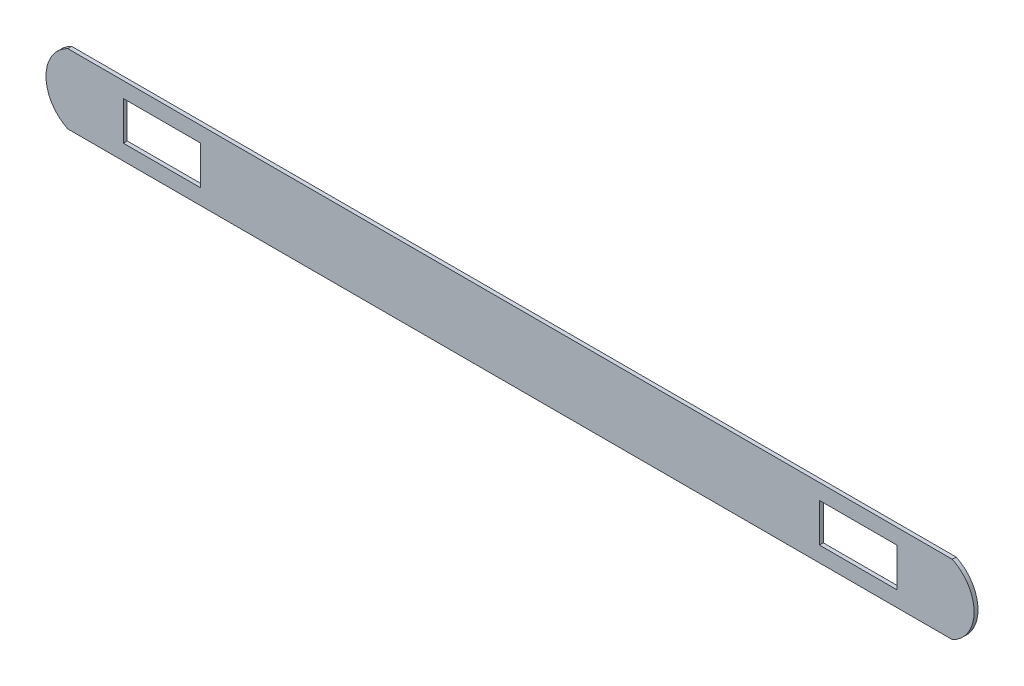
ISO-10303-21;
HEADER;
FILE_DESCRIPTION(('STEP AP214'),'2;1');
FILE_NAME('part.step','',(''),(''),'','','');
FILE_SCHEMA(('AUTOMOTIVE_DESIGN { 1 0 10303 214 1 1 1 1 }'));
ENDSEC;
DATA;
#1=APPLICATION_CONTEXT('core data for automotive mechanical design processes');
#2=APPLICATION_PROTOCOL_DEFINITION('international standard','automotive_design',2000,#1);
#3=PRODUCT_CONTEXT('',#1,'mechanical');
#4=PRODUCT('Part','Part','',(#3));
#5=PRODUCT_RELATED_PRODUCT_CATEGORY('part','',(#4));
#6=PRODUCT_DEFINITION_FORMATION('','',#4);
#7=PRODUCT_DEFINITION_CONTEXT('part definition',#1,'design');
#8=PRODUCT_DEFINITION('design','',#6,#7);
#9=PRODUCT_DEFINITION_SHAPE('','',#8);
#10=(LENGTH_UNIT() NAMED_UNIT(*) SI_UNIT(.MILLI.,.METRE.));
#11=(NAMED_UNIT(*) PLANE_ANGLE_UNIT() SI_UNIT($,.RADIAN.));
#12=(NAMED_UNIT(*) SI_UNIT($,.STERADIAN.) SOLID_ANGLE_UNIT());
#13=UNCERTAINTY_MEASURE_WITH_UNIT(LENGTH_MEASURE(1.E-05),#10,'distance_accuracy_value','');
#14=(GEOMETRIC_REPRESENTATION_CONTEXT(3) GLOBAL_UNCERTAINTY_ASSIGNED_CONTEXT((#13)) GLOBAL_UNIT_ASSIGNED_CONTEXT((#10,
#11,#12)) REPRESENTATION_CONTEXT('',''));
#15=CARTESIAN_POINT('',(0.,0.,0.));
#16=DIRECTION('',(0.,0.,1.));
#17=DIRECTION('',(1.,0.,0.));
#18=AXIS2_PLACEMENT_3D('',#15,#16,#17);
#19=CARTESIAN_POINT('',(0.,-45.,0.));
#20=DIRECTION('',(0.,1.,0.));
#21=DIRECTION('',(0.,0.,1.));
#22=AXIS2_PLACEMENT_3D('',#19,#20,#21);
#23=PLANE('',#22);
#24=DIRECTION('',(0.,0.,-1.));
#25=VECTOR('',#24,1.);
#26=CARTESIAN_POINT('',(-524.528236675635,-45.,80.));
#27=LINE('',#26,#25);
#28=CARTESIAN_POINT('',(-524.528236675635,-45.,0.));
#29=VERTEX_POINT('',#28);
#30=CARTESIAN_POINT('',(-524.528236675635,-45.,5.));
#31=VERTEX_POINT('',#30);
#32=EDGE_CURVE('E136',#29,#31,#27,.F.);
#33=ORIENTED_EDGE('',*,*,#32,.F.);
#34=DIRECTION('',(-1.,0.,0.));
#35=VECTOR('',#34,1.);
#36=CARTESIAN_POINT('',(-502.733741957931,-45.,0.));
#37=LINE('',#36,#35);
#38=CARTESIAN_POINT('',(619.060752759772,-45.,0.));
#39=VERTEX_POINT('',#38);
#40=EDGE_CURVE('E133',#39,#29,#37,.T.);
#41=ORIENTED_EDGE('',*,*,#40,.F.);
#42=DIRECTION('',(0.,0.,-1.));
#43=VECTOR('',#42,1.);
#44=CARTESIAN_POINT('',(619.060752759772,-45.,80.));
#45=LINE('',#44,#43);
#46=CARTESIAN_POINT('',(619.060752759772,-45.,5.));
#47=VERTEX_POINT('',#46);
#48=EDGE_CURVE('E135',#47,#39,#45,.T.);
#49=ORIENTED_EDGE('',*,*,#48,.F.);
#50=DIRECTION('',(-1.,0.,0.));
#51=VECTOR('',#50,1.);
#52=CARTESIAN_POINT('',(597.266258042068,-45.,5.));
#53=LINE('',#52,#51);
#54=EDGE_CURVE('E123',#47,#31,#53,.T.);
#55=ORIENTED_EDGE('',*,*,#54,.T.);
#56=EDGE_LOOP('',(#33,#41,#49,#55));
#57=FACE_BOUND('',#56,.T.);
#58=ADVANCED_FACE('F34',(#57),#23,.F.);
#59=CARTESIAN_POINT('',(447.266258042068,-25.,-5.));
#60=DIRECTION('',(0.,-1.,0.));
#61=DIRECTION('',(0.,0.,-1.));
#62=AXIS2_PLACEMENT_3D('',#59,#60,#61);
#63=PLANE('',#62);
#64=DIRECTION('',(0.,0.,1.));
#65=VECTOR('',#64,1.);
#66=CARTESIAN_POINT('',(447.266258042068,-25.,-5.));
#67=LINE('',#66,#65);
#68=CARTESIAN_POINT('',(447.266258042068,-25.,0.));
#69=VERTEX_POINT('',#68);
#70=CARTESIAN_POINT('',(447.266258042068,-25.,5.));
#71=VERTEX_POINT('',#70);
#72=EDGE_CURVE('E178',#69,#71,#67,.T.);
#73=ORIENTED_EDGE('',*,*,#72,.T.);
#74=DIRECTION('',(1.,0.,0.));
#75=VECTOR('',#74,1.);
#76=CARTESIAN_POINT('',(447.266258042068,-25.,5.));
#77=LINE('',#76,#75);
#78=CARTESIAN_POINT('',(547.266258042068,-25.,5.));
#79=VERTEX_POINT('',#78);
#80=EDGE_CURVE('E194',#71,#79,#77,.T.);
#81=ORIENTED_EDGE('',*,*,#80,.T.);
#82=DIRECTION('',(0.,0.,1.));
#83=VECTOR('',#82,1.);
#84=CARTESIAN_POINT('',(547.266258042068,-25.,-5.));
#85=LINE('',#84,#83);
#86=CARTESIAN_POINT('',(547.266258042068,-25.,0.));
#87=VERTEX_POINT('',#86);
#88=EDGE_CURVE('E181',#87,#79,#85,.T.);
#89=ORIENTED_EDGE('',*,*,#88,.F.);
#90=DIRECTION('',(1.,0.,0.));
#91=VECTOR('',#90,1.);
#92=CARTESIAN_POINT('',(-502.733741957931,-25.,0.));
#93=LINE('',#92,#91);
#94=EDGE_CURVE('E174',#69,#87,#93,.T.);
#95=ORIENTED_EDGE('',*,*,#94,.F.);
#96=EDGE_LOOP('',(#73,#81,#89,#95));
#97=FACE_BOUND('',#96,.T.);
#98=ADVANCED_FACE('F245',(#97),#63,.F.);
#99=CARTESIAN_POINT('',(547.266258042068,25.,-5.));
#100=DIRECTION('',(1.,0.,0.));
#101=DIRECTION('',(0.,0.,-1.));
#102=AXIS2_PLACEMENT_3D('',#99,#100,#101);
#103=PLANE('',#102);
#104=ORIENTED_EDGE('',*,*,#88,.T.);
#105=DIRECTION('',(0.,1.,0.));
#106=VECTOR('',#105,1.);
#107=CARTESIAN_POINT('',(547.266258042068,25.,5.));
#108=LINE('',#107,#106);
#109=CARTESIAN_POINT('',(547.266258042068,25.,5.));
#110=VERTEX_POINT('',#109);
#111=EDGE_CURVE('E191',#79,#110,#108,.T.);
#112=ORIENTED_EDGE('',*,*,#111,.T.);
#113=DIRECTION('',(0.,0.,1.));
#114=VECTOR('',#113,1.);
#115=CARTESIAN_POINT('',(547.266258042068,25.,-5.));
#116=LINE('',#115,#114);
#117=CARTESIAN_POINT('',(547.266258042068,25.,0.));
#118=VERTEX_POINT('',#117);
#119=EDGE_CURVE('E184',#118,#110,#116,.T.);
#120=ORIENTED_EDGE('',*,*,#119,.F.);
#121=DIRECTION('',(0.,1.,0.));
#122=VECTOR('',#121,1.);
#123=CARTESIAN_POINT('',(547.266258042068,0.,0.));
#124=LINE('',#123,#122);
#125=EDGE_CURVE('E171',#87,#118,#124,.T.);
#126=ORIENTED_EDGE('',*,*,#125,.F.);
#127=EDGE_LOOP('',(#104,#112,#120,#126));
#128=FACE_BOUND('',#127,.T.);
#129=ADVANCED_FACE('F250',(#128),#103,.F.);
#130=CARTESIAN_POINT('',(447.266258042068,25.,-5.));
#131=DIRECTION('',(0.,1.,0.));
#132=DIRECTION('',(-1.,0.,0.));
#133=AXIS2_PLACEMENT_3D('',#130,#131,#132);
#134=PLANE('',#133);
#135=ORIENTED_EDGE('',*,*,#119,.T.);
#136=DIRECTION('',(-1.,0.,0.));
#137=VECTOR('',#136,1.);
#138=CARTESIAN_POINT('',(447.266258042068,25.,5.));
#139=LINE('',#138,#137);
#140=CARTESIAN_POINT('',(447.266258042068,25.,5.));
#141=VERTEX_POINT('',#140);
#142=EDGE_CURVE('E182',#110,#141,#139,.T.);
#143=ORIENTED_EDGE('',*,*,#142,.T.);
#144=DIRECTION('',(0.,0.,1.));
#145=VECTOR('',#144,1.);
#146=CARTESIAN_POINT('',(447.266258042068,25.,-5.));
#147=LINE('',#146,#145);
#148=CARTESIAN_POINT('',(447.266258042068,25.,0.));
#149=VERTEX_POINT('',#148);
#150=EDGE_CURVE('E186',#149,#141,#147,.T.);
#151=ORIENTED_EDGE('',*,*,#150,.F.);
#152=DIRECTION('',(-1.,0.,0.));
#153=VECTOR('',#152,1.);
#154=CARTESIAN_POINT('',(-502.733741957931,25.0000000000004,0.));
#155=LINE('',#154,#153);
#156=EDGE_CURVE('E168',#118,#149,#155,.T.);
#157=ORIENTED_EDGE('',*,*,#156,.F.);
#158=EDGE_LOOP('',(#135,#143,#151,#157));
#159=FACE_BOUND('',#158,.T.);
#160=ADVANCED_FACE('F275',(#159),#134,.F.);
#161=CARTESIAN_POINT('',(447.266258042068,25.,-5.));
#162=DIRECTION('',(-1.,0.,0.));
#163=DIRECTION('',(0.,0.,1.));
#164=AXIS2_PLACEMENT_3D('',#161,#162,#163);
#165=PLANE('',#164);
#166=ORIENTED_EDGE('',*,*,#150,.T.);
#167=DIRECTION('',(0.,-1.,0.));
#168=VECTOR('',#167,1.);
#169=CARTESIAN_POINT('',(447.266258042068,25.,5.));
#170=LINE('',#169,#168);
#171=EDGE_CURVE('E149',#141,#71,#170,.T.);
#172=ORIENTED_EDGE('',*,*,#171,.T.);
#173=ORIENTED_EDGE('',*,*,#72,.F.);
#174=DIRECTION('',(0.,-1.,0.));
#175=VECTOR('',#174,1.);
#176=CARTESIAN_POINT('',(447.266258042068,0.,0.));
#177=LINE('',#176,#175);
#178=EDGE_CURVE('E165',#149,#69,#177,.T.);
#179=ORIENTED_EDGE('',*,*,#178,.F.);
#180=EDGE_LOOP('',(#166,#172,#173,#179));
#181=FACE_BOUND('',#180,.T.);
#182=ADVANCED_FACE('F273',(#181),#165,.F.);
#183=CARTESIAN_POINT('',(-452.733741957932,-25.,-5.));
#184=DIRECTION('',(0.,-1.,0.));
#185=DIRECTION('',(0.,0.,-1.));
#186=AXIS2_PLACEMENT_3D('',#183,#184,#185);
#187=PLANE('',#186);
#188=DIRECTION('',(0.,0.,1.));
#189=VECTOR('',#188,1.);
#190=CARTESIAN_POINT('',(-452.733741957932,-25.,-5.));
#191=LINE('',#190,#189);
#192=CARTESIAN_POINT('',(-452.733741957932,-25.,0.));
#193=VERTEX_POINT('',#192);
#194=CARTESIAN_POINT('',(-452.733741957931,-25.,5.));
#195=VERTEX_POINT('',#194);
#196=EDGE_CURVE('E198',#193,#195,#191,.T.);
#197=ORIENTED_EDGE('',*,*,#196,.T.);
#198=DIRECTION('',(1.,0.,0.));
#199=VECTOR('',#198,1.);
#200=CARTESIAN_POINT('',(-452.733741957932,-25.,5.));
#201=LINE('',#200,#199);
#202=CARTESIAN_POINT('',(-352.733741957931,-25.,5.));
#203=VERTEX_POINT('',#202);
#204=EDGE_CURVE('E212',#195,#203,#201,.T.);
#205=ORIENTED_EDGE('',*,*,#204,.T.);
#206=DIRECTION('',(0.,0.,1.));
#207=VECTOR('',#206,1.);
#208=CARTESIAN_POINT('',(-352.733741957931,-25.,-5.));
#209=LINE('',#208,#207);
#210=CARTESIAN_POINT('',(-352.733741957931,-25.,0.));
#211=VERTEX_POINT('',#210);
#212=EDGE_CURVE('E201',#211,#203,#209,.T.);
#213=ORIENTED_EDGE('',*,*,#212,.F.);
#214=DIRECTION('',(1.,0.,0.));
#215=VECTOR('',#214,1.);
#216=CARTESIAN_POINT('',(-502.733741957931,-25.,0.));
#217=LINE('',#216,#215);
#218=EDGE_CURVE('E162',#193,#211,#217,.T.);
#219=ORIENTED_EDGE('',*,*,#218,.F.);
#220=EDGE_LOOP('',(#197,#205,#213,#219));
#221=FACE_BOUND('',#220,.T.);
#222=ADVANCED_FACE('F223',(#221),#187,.F.);
#223=CARTESIAN_POINT('',(-352.733741957931,25.,-5.));
#224=DIRECTION('',(1.,0.,0.));
#225=DIRECTION('',(0.,0.,-1.));
#226=AXIS2_PLACEMENT_3D('',#223,#224,#225);
#227=PLANE('',#226);
#228=ORIENTED_EDGE('',*,*,#212,.T.);
#229=DIRECTION('',(0.,1.,0.));
#230=VECTOR('',#229,1.);
#231=CARTESIAN_POINT('',(-352.733741957931,25.,5.));
#232=LINE('',#231,#230);
#233=CARTESIAN_POINT('',(-352.733741957931,25.,5.));
#234=VERTEX_POINT('',#233);
#235=EDGE_CURVE('E209',#203,#234,#232,.T.);
#236=ORIENTED_EDGE('',*,*,#235,.T.);
#237=DIRECTION('',(0.,0.,1.));
#238=VECTOR('',#237,1.);
#239=CARTESIAN_POINT('',(-352.733741957931,25.,-5.));
#240=LINE('',#239,#238);
#241=CARTESIAN_POINT('',(-352.733741957931,25.,0.));
#242=VERTEX_POINT('',#241);
#243=EDGE_CURVE('E204',#242,#234,#240,.T.);
#244=ORIENTED_EDGE('',*,*,#243,.F.);
#245=DIRECTION('',(0.,1.,0.));
#246=VECTOR('',#245,1.);
#247=CARTESIAN_POINT('',(-352.733741957931,0.,0.));
#248=LINE('',#247,#246);
#249=EDGE_CURVE('E159',#211,#242,#248,.T.);
#250=ORIENTED_EDGE('',*,*,#249,.F.);
#251=EDGE_LOOP('',(#228,#236,#244,#250));
#252=FACE_BOUND('',#251,.T.);
#253=ADVANCED_FACE('F228',(#252),#227,.F.);
#254=CARTESIAN_POINT('',(-452.733741957932,25.,-5.));
#255=DIRECTION('',(0.,1.,0.));
#256=DIRECTION('',(0.,0.,1.));
#257=AXIS2_PLACEMENT_3D('',#254,#255,#256);
#258=PLANE('',#257);
#259=ORIENTED_EDGE('',*,*,#243,.T.);
#260=DIRECTION('',(-1.,0.,0.));
#261=VECTOR('',#260,1.);
#262=CARTESIAN_POINT('',(-452.733741957932,25.,5.));
#263=LINE('',#262,#261);
#264=CARTESIAN_POINT('',(-452.733741957932,25.,5.));
#265=VERTEX_POINT('',#264);
#266=EDGE_CURVE('E202',#234,#265,#263,.T.);
#267=ORIENTED_EDGE('',*,*,#266,.T.);
#268=DIRECTION('',(0.,0.,1.));
#269=VECTOR('',#268,1.);
#270=CARTESIAN_POINT('',(-452.733741957932,25.,-5.));
#271=LINE('',#270,#269);
#272=CARTESIAN_POINT('',(-452.733741957932,25.,0.));
#273=VERTEX_POINT('',#272);
#274=EDGE_CURVE('E177',#273,#265,#271,.T.);
#275=ORIENTED_EDGE('',*,*,#274,.F.);
#276=DIRECTION('',(-1.,0.,0.));
#277=VECTOR('',#276,1.);
#278=CARTESIAN_POINT('',(-502.733741957931,25.,0.));
#279=LINE('',#278,#277);
#280=EDGE_CURVE('E156',#242,#273,#279,.T.);
#281=ORIENTED_EDGE('',*,*,#280,.F.);
#282=EDGE_LOOP('',(#259,#267,#275,#281));
#283=FACE_BOUND('',#282,.T.);
#284=ADVANCED_FACE('F234',(#283),#258,.F.);
#285=CARTESIAN_POINT('',(-452.733741957932,25.,-5.));
#286=DIRECTION('',(-1.,0.,0.));
#287=DIRECTION('',(0.,0.,1.));
#288=AXIS2_PLACEMENT_3D('',#285,#286,#287);
#289=PLANE('',#288);
#290=ORIENTED_EDGE('',*,*,#274,.T.);
#291=DIRECTION('',(0.,-1.,0.));
#292=VECTOR('',#291,1.);
#293=CARTESIAN_POINT('',(-452.733741957932,25.,5.));
#294=LINE('',#293,#292);
#295=EDGE_CURVE('E188',#265,#195,#294,.T.);
#296=ORIENTED_EDGE('',*,*,#295,.T.);
#297=ORIENTED_EDGE('',*,*,#196,.F.);
#298=DIRECTION('',(0.,-1.,0.));
#299=VECTOR('',#298,1.);
#300=CARTESIAN_POINT('',(-452.733741957932,0.,0.));
#301=LINE('',#300,#299);
#302=EDGE_CURVE('E148',#273,#193,#301,.T.);
#303=ORIENTED_EDGE('',*,*,#302,.F.);
#304=EDGE_LOOP('',(#290,#296,#297,#303));
#305=FACE_BOUND('',#304,.T.);
#306=ADVANCED_FACE('F218',(#305),#289,.F.);
#307=CARTESIAN_POINT('',(597.266258042068,0.,80.));
#308=DIRECTION('',(0.,0.,-1.));
#309=DIRECTION('',(-1.,0.,0.));
#310=AXIS2_PLACEMENT_3D('',#307,#308,#309);
#311=CYLINDRICAL_SURFACE('',#310,50.);
#312=CARTESIAN_POINT('',(597.266258042068,0.,5.));
#313=DIRECTION('',(0.,0.,1.));
#314=DIRECTION('',(1.,0.,0.));
#315=AXIS2_PLACEMENT_3D('',#312,#313,#314);
#316=CIRCLE('',#315,50.);
#317=CARTESIAN_POINT('',(619.060752759772,45.,5.));
#318=VERTEX_POINT('',#317);
#319=EDGE_CURVE('E51',#47,#318,#316,.T.);
#320=ORIENTED_EDGE('',*,*,#319,.F.);
#321=ORIENTED_EDGE('',*,*,#48,.T.);
#322=CARTESIAN_POINT('',(597.266258042068,0.,0.));
#323=DIRECTION('',(0.,0.,1.));
#324=DIRECTION('',(1.,0.,0.));
#325=AXIS2_PLACEMENT_3D('',#322,#323,#324);
#326=CIRCLE('',#325,50.);
#327=CARTESIAN_POINT('',(619.060752759772,45.,0.));
#328=VERTEX_POINT('',#327);
#329=EDGE_CURVE('E38',#39,#328,#326,.T.);
#330=ORIENTED_EDGE('',*,*,#329,.T.);
#331=DIRECTION('',(0.,0.,-1.));
#332=VECTOR('',#331,1.);
#333=CARTESIAN_POINT('',(619.060752759772,45.,80.));
#334=LINE('',#333,#332);
#335=EDGE_CURVE('E11',#328,#318,#334,.F.);
#336=ORIENTED_EDGE('',*,*,#335,.T.);
#337=EDGE_LOOP('',(#320,#321,#330,#336));
#338=FACE_BOUND('',#337,.T.);
#339=ADVANCED_FACE('F138',(#338),#311,.T.);
#340=CARTESIAN_POINT('',(0.,45.,0.));
#341=DIRECTION('',(0.,-1.,0.));
#342=DIRECTION('',(0.,0.,-1.));
#343=AXIS2_PLACEMENT_3D('',#340,#341,#342);
#344=PLANE('',#343);
#345=ORIENTED_EDGE('',*,*,#335,.F.);
#346=DIRECTION('',(1.,0.,0.));
#347=VECTOR('',#346,1.);
#348=CARTESIAN_POINT('',(-502.733741957931,45.,0.));
#349=LINE('',#348,#347);
#350=CARTESIAN_POINT('',(-524.528236675635,45.,0.));
#351=VERTEX_POINT('',#350);
#352=EDGE_CURVE('E132',#351,#328,#349,.T.);
#353=ORIENTED_EDGE('',*,*,#352,.F.);
#354=DIRECTION('',(0.,0.,-1.));
#355=VECTOR('',#354,1.);
#356=CARTESIAN_POINT('',(-524.528236675635,45.,80.));
#357=LINE('',#356,#355);
#358=CARTESIAN_POINT('',(-524.528236675635,45.,5.));
#359=VERTEX_POINT('',#358);
#360=EDGE_CURVE('E43',#359,#351,#357,.T.);
#361=ORIENTED_EDGE('',*,*,#360,.F.);
#362=DIRECTION('',(1.,0.,0.));
#363=VECTOR('',#362,1.);
#364=CARTESIAN_POINT('',(597.266258042068,45.,5.));
#365=LINE('',#364,#363);
#366=EDGE_CURVE('E142',#359,#318,#365,.T.);
#367=ORIENTED_EDGE('',*,*,#366,.T.);
#368=EDGE_LOOP('',(#345,#353,#361,#367));
#369=FACE_BOUND('',#368,.T.);
#370=ADVANCED_FACE('F264',(#369),#344,.F.);
#371=CARTESIAN_POINT('',(597.266258042068,-45.,5.));
#372=DIRECTION('',(0.,0.,1.));
#373=DIRECTION('',(1.,0.,0.));
#374=AXIS2_PLACEMENT_3D('',#371,#372,#373);
#375=PLANE('',#374);
#376=ORIENTED_EDGE('',*,*,#54,.F.);
#377=ORIENTED_EDGE('',*,*,#319,.T.);
#378=ORIENTED_EDGE('',*,*,#366,.F.);
#379=CARTESIAN_POINT('',(-502.733741957931,0.,5.));
#380=DIRECTION('',(0.,0.,1.));
#381=DIRECTION('',(1.,0.,0.));
#382=AXIS2_PLACEMENT_3D('',#379,#380,#381);
#383=CIRCLE('',#382,50.);
#384=EDGE_CURVE('E128',#359,#31,#383,.T.);
#385=ORIENTED_EDGE('',*,*,#384,.T.);
#386=EDGE_LOOP('',(#376,#377,#378,#385));
#387=FACE_BOUND('',#386,.T.);
#388=ORIENTED_EDGE('',*,*,#295,.F.);
#389=ORIENTED_EDGE('',*,*,#266,.F.);
#390=ORIENTED_EDGE('',*,*,#235,.F.);
#391=ORIENTED_EDGE('',*,*,#204,.F.);
#392=EDGE_LOOP('',(#388,#389,#390,#391));
#393=FACE_BOUND('',#392,.T.);
#394=ORIENTED_EDGE('',*,*,#171,.F.);
#395=ORIENTED_EDGE('',*,*,#142,.F.);
#396=ORIENTED_EDGE('',*,*,#111,.F.);
#397=ORIENTED_EDGE('',*,*,#80,.F.);
#398=EDGE_LOOP('',(#394,#395,#396,#397));
#399=FACE_BOUND('',#398,.T.);
#400=ADVANCED_FACE('F125',(#387,#393,#399),#375,.T.);
#401=CARTESIAN_POINT('',(-502.733741957931,0.,0.));
#402=DIRECTION('',(0.,0.,1.));
#403=DIRECTION('',(1.,0.,0.));
#404=AXIS2_PLACEMENT_3D('',#401,#402,#403);
#405=PLANE('',#404);
#406=ORIENTED_EDGE('',*,*,#329,.F.);
#407=ORIENTED_EDGE('',*,*,#40,.T.);
#408=CARTESIAN_POINT('',(-502.733741957931,0.,0.));
#409=DIRECTION('',(0.,0.,1.));
#410=DIRECTION('',(1.,0.,0.));
#411=AXIS2_PLACEMENT_3D('',#408,#409,#410);
#412=CIRCLE('',#411,50.);
#413=EDGE_CURVE('E145',#351,#29,#412,.T.);
#414=ORIENTED_EDGE('',*,*,#413,.F.);
#415=ORIENTED_EDGE('',*,*,#352,.T.);
#416=EDGE_LOOP('',(#406,#407,#414,#415));
#417=FACE_BOUND('',#416,.T.);
#418=ORIENTED_EDGE('',*,*,#280,.T.);
#419=ORIENTED_EDGE('',*,*,#302,.T.);
#420=ORIENTED_EDGE('',*,*,#218,.T.);
#421=ORIENTED_EDGE('',*,*,#249,.T.);
#422=EDGE_LOOP('',(#418,#419,#420,#421));
#423=FACE_BOUND('',#422,.T.);
#424=ORIENTED_EDGE('',*,*,#156,.T.);
#425=ORIENTED_EDGE('',*,*,#178,.T.);
#426=ORIENTED_EDGE('',*,*,#94,.T.);
#427=ORIENTED_EDGE('',*,*,#125,.T.);
#428=EDGE_LOOP('',(#424,#425,#426,#427));
#429=FACE_BOUND('',#428,.T.);
#430=ADVANCED_FACE('F231',(#417,#423,#429),#405,.F.);
#431=CARTESIAN_POINT('',(-502.733741957931,0.,80.));
#432=DIRECTION('',(0.,0.,-1.));
#433=DIRECTION('',(-1.,0.,0.));
#434=AXIS2_PLACEMENT_3D('',#431,#432,#433);
#435=CYLINDRICAL_SURFACE('',#434,50.);
#436=ORIENTED_EDGE('',*,*,#413,.T.);
#437=ORIENTED_EDGE('',*,*,#32,.T.);
#438=ORIENTED_EDGE('',*,*,#384,.F.);
#439=ORIENTED_EDGE('',*,*,#360,.T.);
#440=EDGE_LOOP('',(#436,#437,#438,#439));
#441=FACE_BOUND('',#440,.T.);
#442=ADVANCED_FACE('F36',(#441),#435,.T.);
#443=CLOSED_SHELL('',(#58,#98,#129,#160,#182,#222,#253,#284,#306,#339,#370,#400,#430,#442));
#444=MANIFOLD_SOLID_BREP('B2',#443);
#445=ADVANCED_BREP_SHAPE_REPRESENTATION('',(#18,#444),#14);
#446=SHAPE_DEFINITION_REPRESENTATION(#9,#445);
ENDSEC;
END-ISO-10303-21;
